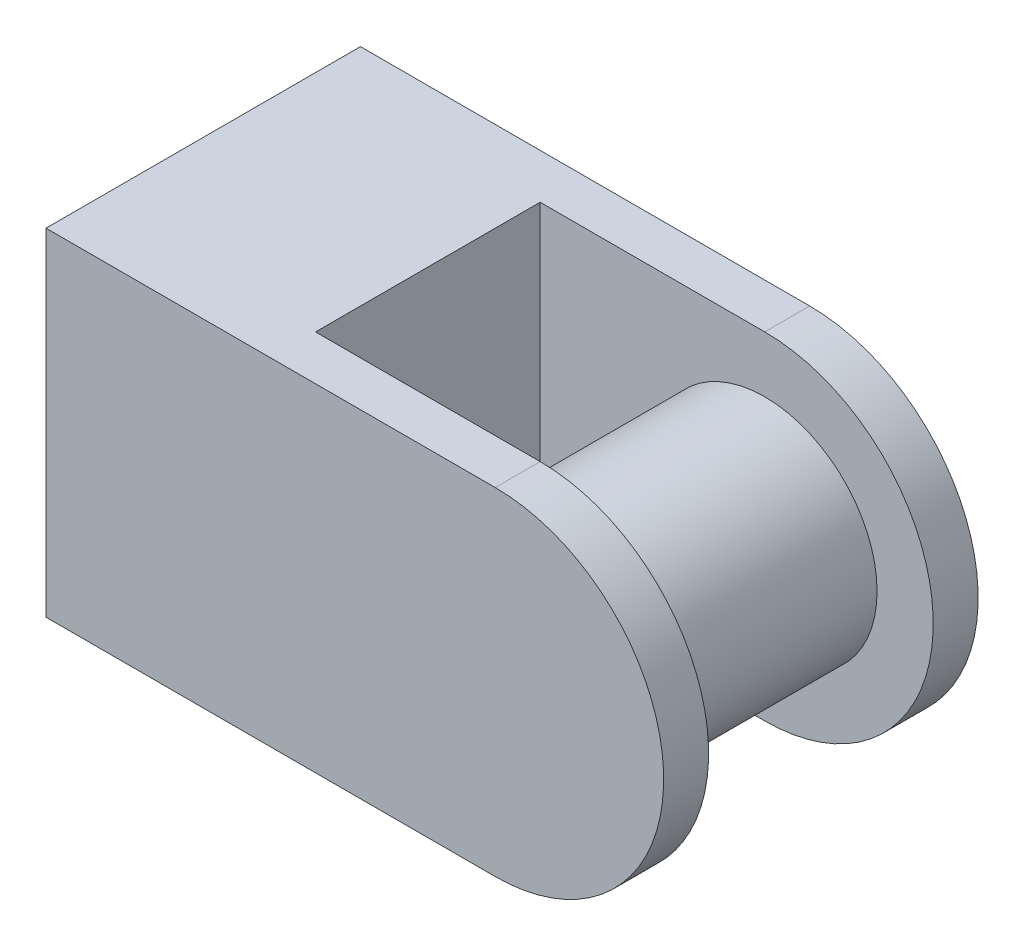
ISO-10303-21;
HEADER;
FILE_DESCRIPTION(('STEP AP214'),'2;1');
FILE_NAME('part.step','',(''),(''),'','','');
FILE_SCHEMA(('AUTOMOTIVE_DESIGN { 1 0 10303 214 1 1 1 1 }'));
ENDSEC;
DATA;
#1=APPLICATION_CONTEXT('core data for automotive mechanical design processes');
#2=APPLICATION_PROTOCOL_DEFINITION('international standard','automotive_design',2000,#1);
#3=PRODUCT_CONTEXT('',#1,'mechanical');
#4=PRODUCT('Part','Part','',(#3));
#5=PRODUCT_RELATED_PRODUCT_CATEGORY('part','',(#4));
#6=PRODUCT_DEFINITION_FORMATION('','',#4);
#7=PRODUCT_DEFINITION_CONTEXT('part definition',#1,'design');
#8=PRODUCT_DEFINITION('design','',#6,#7);
#9=PRODUCT_DEFINITION_SHAPE('','',#8);
#10=(LENGTH_UNIT() NAMED_UNIT(*) SI_UNIT(.MILLI.,.METRE.));
#11=(NAMED_UNIT(*) PLANE_ANGLE_UNIT() SI_UNIT($,.RADIAN.));
#12=(NAMED_UNIT(*) SI_UNIT($,.STERADIAN.) SOLID_ANGLE_UNIT());
#13=UNCERTAINTY_MEASURE_WITH_UNIT(LENGTH_MEASURE(1.E-05),#10,'distance_accuracy_value','');
#14=(GEOMETRIC_REPRESENTATION_CONTEXT(3) GLOBAL_UNCERTAINTY_ASSIGNED_CONTEXT((#13)) GLOBAL_UNIT_ASSIGNED_CONTEXT((#10,
#11,#12)) REPRESENTATION_CONTEXT('',''));
#15=CARTESIAN_POINT('',(0.,0.,0.));
#16=DIRECTION('',(0.,0.,1.));
#17=DIRECTION('',(1.,0.,0.));
#18=AXIS2_PLACEMENT_3D('',#15,#16,#17);
#19=CARTESIAN_POINT('',(520.,0.,70.));
#20=DIRECTION('',(0.,0.,-1.));
#21=DIRECTION('',(-1.,0.,0.));
#22=AXIS2_PLACEMENT_3D('',#19,#20,#21);
#23=CYLINDRICAL_SURFACE('',#22,75.);
#24=CARTESIAN_POINT('',(520.,0.,-50.));
#25=DIRECTION('',(0.,0.,1.));
#26=DIRECTION('',(1.,0.,0.));
#27=AXIS2_PLACEMENT_3D('',#24,#25,#26);
#28=CIRCLE('',#27,75.);
#29=CARTESIAN_POINT('',(520.,-75.,-50.));
#30=VERTEX_POINT('',#29);
#31=CARTESIAN_POINT('',(520.,75.,-50.));
#32=VERTEX_POINT('',#31);
#33=EDGE_CURVE('E126',#30,#32,#28,.T.);
#34=ORIENTED_EDGE('',*,*,#33,.F.);
#35=DIRECTION('',(0.,0.,-1.));
#36=VECTOR('',#35,1.);
#37=CARTESIAN_POINT('',(520.,-75.,70.));
#38=LINE('',#37,#36);
#39=CARTESIAN_POINT('',(520.,-75.,-70.));
#40=VERTEX_POINT('',#39);
#41=EDGE_CURVE('E96',#30,#40,#38,.T.);
#42=ORIENTED_EDGE('',*,*,#41,.T.);
#43=CARTESIAN_POINT('',(520.,0.,-70.));
#44=DIRECTION('',(0.,0.,1.));
#45=DIRECTION('',(1.,0.,0.));
#46=AXIS2_PLACEMENT_3D('',#43,#44,#45);
#47=CIRCLE('',#46,75.);
#48=CARTESIAN_POINT('',(520.,75.,-70.));
#49=VERTEX_POINT('',#48);
#50=EDGE_CURVE('E145',#40,#49,#47,.T.);
#51=ORIENTED_EDGE('',*,*,#50,.T.);
#52=DIRECTION('',(0.,0.,-1.));
#53=VECTOR('',#52,1.);
#54=CARTESIAN_POINT('',(520.,75.,70.));
#55=LINE('',#54,#53);
#56=EDGE_CURVE('E138',#32,#49,#55,.T.);
#57=ORIENTED_EDGE('',*,*,#56,.F.);
#58=EDGE_LOOP('',(#34,#42,#51,#57));
#59=FACE_BOUND('',#58,.T.);
#60=ADVANCED_FACE('F50',(#59),#23,.T.);
#61=CARTESIAN_POINT('',(520.,75.,70.));
#62=DIRECTION('',(0.,-1.,0.));
#63=DIRECTION('',(1.,0.,0.));
#64=AXIS2_PLACEMENT_3D('',#61,#62,#63);
#65=PLANE('',#64);
#66=DIRECTION('',(-1.,0.,0.));
#67=VECTOR('',#66,1.);
#68=CARTESIAN_POINT('',(520.,75.,-50.));
#69=LINE('',#68,#67);
#70=CARTESIAN_POINT('',(420.,75.,-50.));
#71=VERTEX_POINT('',#70);
#72=EDGE_CURVE('E130',#32,#71,#69,.T.);
#73=ORIENTED_EDGE('',*,*,#72,.F.);
#74=ORIENTED_EDGE('',*,*,#56,.T.);
#75=DIRECTION('',(-1.,0.,0.));
#76=VECTOR('',#75,1.);
#77=CARTESIAN_POINT('',(520.,75.,-70.));
#78=LINE('',#77,#76);
#79=CARTESIAN_POINT('',(320.,75.,-70.));
#80=VERTEX_POINT('',#79);
#81=EDGE_CURVE('E161',#49,#80,#78,.T.);
#82=ORIENTED_EDGE('',*,*,#81,.T.);
#83=DIRECTION('',(0.,0.,-1.));
#84=VECTOR('',#83,1.);
#85=CARTESIAN_POINT('',(320.,75.,70.));
#86=LINE('',#85,#84);
#87=CARTESIAN_POINT('',(320.,75.,70.));
#88=VERTEX_POINT('',#87);
#89=EDGE_CURVE('E146',#88,#80,#86,.T.);
#90=ORIENTED_EDGE('',*,*,#89,.F.);
#91=DIRECTION('',(-1.,0.,0.));
#92=VECTOR('',#91,1.);
#93=CARTESIAN_POINT('',(520.,75.,70.));
#94=LINE('',#93,#92);
#95=CARTESIAN_POINT('',(520.,75.,70.));
#96=VERTEX_POINT('',#95);
#97=EDGE_CURVE('E104',#96,#88,#94,.T.);
#98=ORIENTED_EDGE('',*,*,#97,.F.);
#99=CARTESIAN_POINT('',(520.,75.,50.));
#100=VERTEX_POINT('',#99);
#101=EDGE_CURVE('E58',#96,#100,#55,.T.);
#102=ORIENTED_EDGE('',*,*,#101,.T.);
#103=DIRECTION('',(-1.,0.,0.));
#104=VECTOR('',#103,1.);
#105=CARTESIAN_POINT('',(520.,75.,50.));
#106=LINE('',#105,#104);
#107=CARTESIAN_POINT('',(420.,75.,50.));
#108=VERTEX_POINT('',#107);
#109=EDGE_CURVE('E176',#100,#108,#106,.T.);
#110=ORIENTED_EDGE('',*,*,#109,.T.);
#111=DIRECTION('',(0.,0.,1.));
#112=VECTOR('',#111,1.);
#113=CARTESIAN_POINT('',(420.,75.,-50.));
#114=LINE('',#113,#112);
#115=EDGE_CURVE('E141',#71,#108,#114,.T.);
#116=ORIENTED_EDGE('',*,*,#115,.F.);
#117=EDGE_LOOP('',(#73,#74,#82,#90,#98,#102,#110,#116));
#118=FACE_BOUND('',#117,.T.);
#119=ADVANCED_FACE('F137',(#118),#65,.F.);
#120=CARTESIAN_POINT('',(320.,-75.,70.));
#121=DIRECTION('',(0.,1.,0.));
#122=DIRECTION('',(-1.,0.,0.));
#123=AXIS2_PLACEMENT_3D('',#120,#121,#122);
#124=PLANE('',#123);
#125=DIRECTION('',(1.,0.,0.));
#126=VECTOR('',#125,1.);
#127=CARTESIAN_POINT('',(420.,-75.,-50.));
#128=LINE('',#127,#126);
#129=CARTESIAN_POINT('',(420.,-75.,-50.));
#130=VERTEX_POINT('',#129);
#131=EDGE_CURVE('E133',#130,#30,#128,.T.);
#132=ORIENTED_EDGE('',*,*,#131,.F.);
#133=DIRECTION('',(0.,0.,1.));
#134=VECTOR('',#133,1.);
#135=CARTESIAN_POINT('',(420.,-75.,-50.));
#136=LINE('',#135,#134);
#137=CARTESIAN_POINT('',(420.,-75.,50.));
#138=VERTEX_POINT('',#137);
#139=EDGE_CURVE('E164',#130,#138,#136,.T.);
#140=ORIENTED_EDGE('',*,*,#139,.T.);
#141=DIRECTION('',(1.,0.,0.));
#142=VECTOR('',#141,1.);
#143=CARTESIAN_POINT('',(420.,-75.,50.));
#144=LINE('',#143,#142);
#145=CARTESIAN_POINT('',(520.,-75.,50.));
#146=VERTEX_POINT('',#145);
#147=EDGE_CURVE('E135',#138,#146,#144,.T.);
#148=ORIENTED_EDGE('',*,*,#147,.T.);
#149=CARTESIAN_POINT('',(520.,-75.,70.));
#150=VERTEX_POINT('',#149);
#151=EDGE_CURVE('E153',#150,#146,#38,.T.);
#152=ORIENTED_EDGE('',*,*,#151,.F.);
#153=DIRECTION('',(1.,0.,0.));
#154=VECTOR('',#153,1.);
#155=CARTESIAN_POINT('',(320.,-75.,70.));
#156=LINE('',#155,#154);
#157=CARTESIAN_POINT('',(320.,-75.,70.));
#158=VERTEX_POINT('',#157);
#159=EDGE_CURVE('E74',#158,#150,#156,.T.);
#160=ORIENTED_EDGE('',*,*,#159,.F.);
#161=DIRECTION('',(0.,0.,-1.));
#162=VECTOR('',#161,1.);
#163=CARTESIAN_POINT('',(320.,-75.,70.));
#164=LINE('',#163,#162);
#165=CARTESIAN_POINT('',(320.,-75.,-70.));
#166=VERTEX_POINT('',#165);
#167=EDGE_CURVE('E148',#158,#166,#164,.T.);
#168=ORIENTED_EDGE('',*,*,#167,.T.);
#169=DIRECTION('',(1.,0.,0.));
#170=VECTOR('',#169,1.);
#171=CARTESIAN_POINT('',(320.,-75.,-70.));
#172=LINE('',#171,#170);
#173=EDGE_CURVE('E156',#166,#40,#172,.T.);
#174=ORIENTED_EDGE('',*,*,#173,.T.);
#175=ORIENTED_EDGE('',*,*,#41,.F.);
#176=EDGE_LOOP('',(#132,#140,#148,#152,#160,#168,#174,#175));
#177=FACE_BOUND('',#176,.T.);
#178=ADVANCED_FACE('F205',(#177),#124,.F.);
#179=ORIENTED_EDGE('',*,*,#151,.T.);
#180=CARTESIAN_POINT('',(520.,0.,50.));
#181=DIRECTION('',(0.,0.,1.));
#182=DIRECTION('',(1.,0.,0.));
#183=AXIS2_PLACEMENT_3D('',#180,#181,#182);
#184=CIRCLE('',#183,75.);
#185=EDGE_CURVE('E65',#146,#100,#184,.T.);
#186=ORIENTED_EDGE('',*,*,#185,.T.);
#187=ORIENTED_EDGE('',*,*,#101,.F.);
#188=CARTESIAN_POINT('',(520.,0.,70.));
#189=DIRECTION('',(0.,0.,1.));
#190=DIRECTION('',(1.,0.,0.));
#191=AXIS2_PLACEMENT_3D('',#188,#189,#190);
#192=CIRCLE('',#191,75.);
#193=EDGE_CURVE('E158',#150,#96,#192,.T.);
#194=ORIENTED_EDGE('',*,*,#193,.F.);
#195=EDGE_LOOP('',(#179,#186,#187,#194));
#196=FACE_BOUND('',#195,.T.);
#197=ADVANCED_FACE('F52',(#196),#23,.T.);
#198=CARTESIAN_POINT('',(320.,75.,70.));
#199=DIRECTION('',(1.,0.,0.));
#200=DIRECTION('',(0.,0.,-1.));
#201=AXIS2_PLACEMENT_3D('',#198,#199,#200);
#202=PLANE('',#201);
#203=DIRECTION('',(0.,-1.,0.));
#204=VECTOR('',#203,1.);
#205=CARTESIAN_POINT('',(320.,75.,-70.));
#206=LINE('',#205,#204);
#207=EDGE_CURVE('E159',#80,#166,#206,.T.);
#208=ORIENTED_EDGE('',*,*,#207,.T.);
#209=ORIENTED_EDGE('',*,*,#167,.F.);
#210=DIRECTION('',(0.,-1.,0.));
#211=VECTOR('',#210,1.);
#212=CARTESIAN_POINT('',(320.,75.,70.));
#213=LINE('',#212,#211);
#214=EDGE_CURVE('E166',#88,#158,#213,.T.);
#215=ORIENTED_EDGE('',*,*,#214,.F.);
#216=ORIENTED_EDGE('',*,*,#89,.T.);
#217=EDGE_LOOP('',(#208,#209,#215,#216));
#218=FACE_BOUND('',#217,.T.);
#219=ADVANCED_FACE('F207',(#218),#202,.F.);
#220=CARTESIAN_POINT('',(520.,0.,70.));
#221=DIRECTION('',(0.,0.,1.));
#222=DIRECTION('',(1.,0.,0.));
#223=AXIS2_PLACEMENT_3D('',#220,#221,#222);
#224=PLANE('',#223);
#225=ORIENTED_EDGE('',*,*,#193,.T.);
#226=ORIENTED_EDGE('',*,*,#97,.T.);
#227=ORIENTED_EDGE('',*,*,#214,.T.);
#228=ORIENTED_EDGE('',*,*,#159,.T.);
#229=EDGE_LOOP('',(#225,#226,#227,#228));
#230=FACE_BOUND('',#229,.T.);
#231=ADVANCED_FACE('F213',(#230),#224,.T.);
#232=CARTESIAN_POINT('',(520.,0.,-70.));
#233=DIRECTION('',(0.,0.,1.));
#234=DIRECTION('',(1.,0.,0.));
#235=AXIS2_PLACEMENT_3D('',#232,#233,#234);
#236=PLANE('',#235);
#237=ORIENTED_EDGE('',*,*,#50,.F.);
#238=ORIENTED_EDGE('',*,*,#173,.F.);
#239=ORIENTED_EDGE('',*,*,#207,.F.);
#240=ORIENTED_EDGE('',*,*,#81,.F.);
#241=EDGE_LOOP('',(#237,#238,#239,#240));
#242=FACE_BOUND('',#241,.T.);
#243=ADVANCED_FACE('F197',(#242),#236,.F.);
#244=CARTESIAN_POINT('',(420.,75.,-50.));
#245=DIRECTION('',(-1.,0.,0.));
#246=DIRECTION('',(0.,0.,1.));
#247=AXIS2_PLACEMENT_3D('',#244,#245,#246);
#248=PLANE('',#247);
#249=DIRECTION('',(0.,-1.,0.));
#250=VECTOR('',#249,1.);
#251=CARTESIAN_POINT('',(420.,75.,50.));
#252=LINE('',#251,#250);
#253=EDGE_CURVE('E174',#108,#138,#252,.T.);
#254=ORIENTED_EDGE('',*,*,#253,.T.);
#255=ORIENTED_EDGE('',*,*,#139,.F.);
#256=DIRECTION('',(0.,-1.,0.));
#257=VECTOR('',#256,1.);
#258=CARTESIAN_POINT('',(420.,75.,-50.));
#259=LINE('',#258,#257);
#260=EDGE_CURVE('E142',#71,#130,#259,.T.);
#261=ORIENTED_EDGE('',*,*,#260,.F.);
#262=ORIENTED_EDGE('',*,*,#115,.T.);
#263=EDGE_LOOP('',(#254,#255,#261,#262));
#264=FACE_BOUND('',#263,.T.);
#265=ADVANCED_FACE('F189',(#264),#248,.F.);
#266=CARTESIAN_POINT('',(520.,0.,-50.));
#267=DIRECTION('',(0.,0.,1.));
#268=DIRECTION('',(1.,0.,0.));
#269=AXIS2_PLACEMENT_3D('',#266,#267,#268);
#270=PLANE('',#269);
#271=CARTESIAN_POINT('',(520.,0.,-50.));
#272=DIRECTION('',(0.,0.,1.));
#273=DIRECTION('',(1.,0.,0.));
#274=AXIS2_PLACEMENT_3D('',#271,#272,#273);
#275=CIRCLE('',#274,50.);
#276=CARTESIAN_POINT('',(570.,0.,-50.));
#277=VERTEX_POINT('',#276);
#278=EDGE_CURVE('E179',#277,#277,#275,.T.);
#279=ORIENTED_EDGE('',*,*,#278,.F.);
#280=EDGE_LOOP('',(#279));
#281=FACE_BOUND('',#280,.T.);
#282=ORIENTED_EDGE('',*,*,#33,.T.);
#283=ORIENTED_EDGE('',*,*,#72,.T.);
#284=ORIENTED_EDGE('',*,*,#260,.T.);
#285=ORIENTED_EDGE('',*,*,#131,.T.);
#286=EDGE_LOOP('',(#282,#283,#284,#285));
#287=FACE_BOUND('',#286,.T.);
#288=ADVANCED_FACE('F128',(#281,#287),#270,.T.);
#289=CARTESIAN_POINT('',(520.,0.,50.));
#290=DIRECTION('',(0.,0.,1.));
#291=DIRECTION('',(1.,0.,0.));
#292=AXIS2_PLACEMENT_3D('',#289,#290,#291);
#293=PLANE('',#292);
#294=CARTESIAN_POINT('',(520.,0.,50.));
#295=DIRECTION('',(0.,0.,1.));
#296=DIRECTION('',(1.,0.,0.));
#297=AXIS2_PLACEMENT_3D('',#294,#295,#296);
#298=CIRCLE('',#297,50.);
#299=CARTESIAN_POINT('',(570.,0.,50.));
#300=VERTEX_POINT('',#299);
#301=EDGE_CURVE('E13',#300,#300,#298,.F.);
#302=ORIENTED_EDGE('',*,*,#301,.F.);
#303=EDGE_LOOP('',(#302));
#304=FACE_BOUND('',#303,.T.);
#305=ORIENTED_EDGE('',*,*,#185,.F.);
#306=ORIENTED_EDGE('',*,*,#147,.F.);
#307=ORIENTED_EDGE('',*,*,#253,.F.);
#308=ORIENTED_EDGE('',*,*,#109,.F.);
#309=EDGE_LOOP('',(#305,#306,#307,#308));
#310=FACE_BOUND('',#309,.T.);
#311=ADVANCED_FACE('F188',(#304,#310),#293,.F.);
#312=CARTESIAN_POINT('',(520.,0.,50.));
#313=DIRECTION('',(0.,0.,-1.));
#314=DIRECTION('',(-1.,0.,0.));
#315=AXIS2_PLACEMENT_3D('',#312,#313,#314);
#316=CYLINDRICAL_SURFACE('',#315,50.);
#317=ORIENTED_EDGE('',*,*,#301,.T.);
#318=EDGE_LOOP('',(#317));
#319=FACE_BOUND('',#318,.T.);
#320=ORIENTED_EDGE('',*,*,#278,.T.);
#321=EDGE_LOOP('',(#320));
#322=FACE_BOUND('',#321,.T.);
#323=ADVANCED_FACE('F185',(#319,#322),#316,.T.);
#324=CLOSED_SHELL('',(#60,#119,#178,#197,#219,#231,#243,#265,#288,#311,#323));
#325=MANIFOLD_SOLID_BREP('B2',#324);
#326=ADVANCED_BREP_SHAPE_REPRESENTATION('',(#18,#325),#14);
#327=SHAPE_DEFINITION_REPRESENTATION(#9,#326);
ENDSEC;
END-ISO-10303-21;
